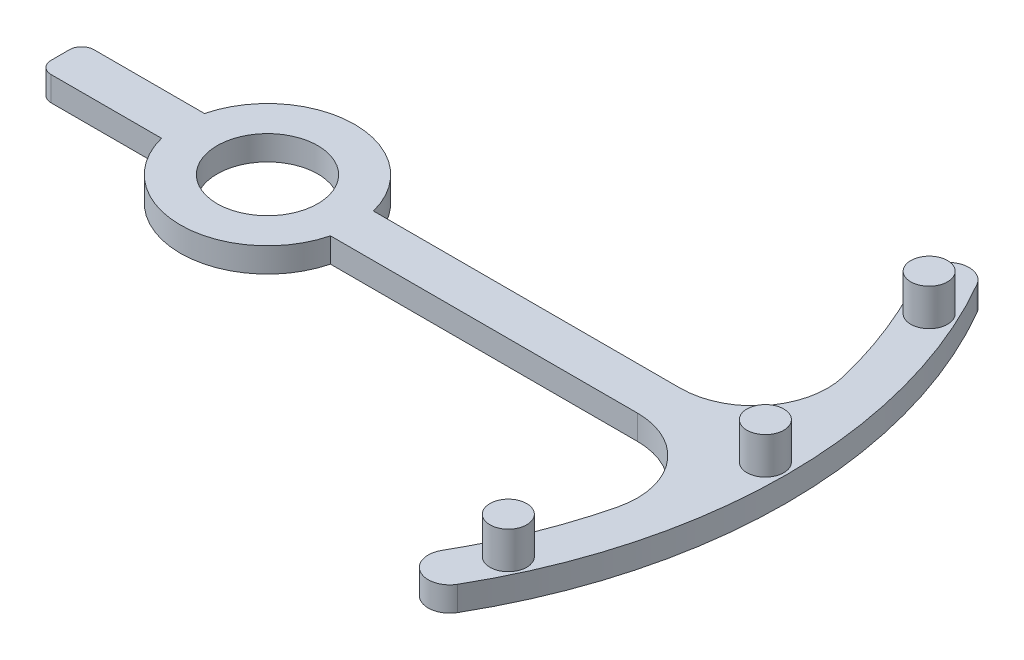
ISO-10303-21;
HEADER;
FILE_DESCRIPTION(('STEP AP214'),'2;1');
FILE_NAME('part.step','',(''),(''),'','','');
FILE_SCHEMA(('AUTOMOTIVE_DESIGN { 1 0 10303 214 1 1 1 1 }'));
ENDSEC;
DATA;
#1=APPLICATION_CONTEXT('core data for automotive mechanical design processes');
#2=APPLICATION_PROTOCOL_DEFINITION('international standard','automotive_design',2000,#1);
#3=PRODUCT_CONTEXT('',#1,'mechanical');
#4=PRODUCT('Part','Part','',(#3));
#5=PRODUCT_RELATED_PRODUCT_CATEGORY('part','',(#4));
#6=PRODUCT_DEFINITION_FORMATION('','',#4);
#7=PRODUCT_DEFINITION_CONTEXT('part definition',#1,'design');
#8=PRODUCT_DEFINITION('design','',#6,#7);
#9=PRODUCT_DEFINITION_SHAPE('','',#8);
#10=(LENGTH_UNIT() NAMED_UNIT(*) SI_UNIT(.MILLI.,.METRE.));
#11=(NAMED_UNIT(*) PLANE_ANGLE_UNIT() SI_UNIT($,.RADIAN.));
#12=(NAMED_UNIT(*) SI_UNIT($,.STERADIAN.) SOLID_ANGLE_UNIT());
#13=UNCERTAINTY_MEASURE_WITH_UNIT(LENGTH_MEASURE(1.E-05),#10,'distance_accuracy_value','');
#14=(GEOMETRIC_REPRESENTATION_CONTEXT(3) GLOBAL_UNCERTAINTY_ASSIGNED_CONTEXT((#13)) GLOBAL_UNIT_ASSIGNED_CONTEXT((#10,
#11,#12)) REPRESENTATION_CONTEXT('',''));
#15=CARTESIAN_POINT('',(0.,0.,0.));
#16=DIRECTION('',(0.,0.,1.));
#17=DIRECTION('',(1.,0.,0.));
#18=AXIS2_PLACEMENT_3D('',#15,#16,#17);
#19=CARTESIAN_POINT('',(0.,2.,0.));
#20=DIRECTION('',(0.,1.,0.));
#21=DIRECTION('',(0.,0.,1.));
#22=AXIS2_PLACEMENT_3D('',#19,#20,#21);
#23=PLANE('',#22);
#24=CARTESIAN_POINT('',(40.5594244591551,2.,0.));
#25=DIRECTION('',(0.,1.,0.));
#26=DIRECTION('',(0.,0.,1.));
#27=AXIS2_PLACEMENT_3D('',#24,#25,#26);
#28=CIRCLE('',#27,1.5);
#29=CARTESIAN_POINT('',(40.5594244591551,2.,1.5));
#30=VERTEX_POINT('',#29);
#31=EDGE_CURVE('E347',#30,#30,#28,.T.);
#32=ORIENTED_EDGE('',*,*,#31,.F.);
#33=EDGE_LOOP('',(#32));
#34=FACE_BOUND('',#33,.T.);
#35=CARTESIAN_POINT('',(36.759322225057,2.,17.1411534621314));
#36=DIRECTION('',(0.,1.,0.));
#37=DIRECTION('',(0.,0.,-1.));
#38=AXIS2_PLACEMENT_3D('',#35,#36,#37);
#39=CIRCLE('',#38,1.5);
#40=CARTESIAN_POINT('',(36.759322225057,2.,15.6411534621314));
#41=VERTEX_POINT('',#40);
#42=EDGE_CURVE('E346',#41,#41,#39,.T.);
#43=ORIENTED_EDGE('',*,*,#42,.F.);
#44=EDGE_LOOP('',(#43));
#45=FACE_BOUND('',#44,.T.);
#46=CARTESIAN_POINT('',(36.759322225057,2.,-17.1411534621314));
#47=DIRECTION('',(0.,1.,0.));
#48=DIRECTION('',(0.,0.,1.));
#49=AXIS2_PLACEMENT_3D('',#46,#47,#48);
#50=CIRCLE('',#49,1.5);
#51=CARTESIAN_POINT('',(36.759322225057,2.,-15.6411534621314));
#52=VERTEX_POINT('',#51);
#53=EDGE_CURVE('E356',#52,#52,#50,.T.);
#54=ORIENTED_EDGE('',*,*,#53,.F.);
#55=EDGE_LOOP('',(#54));
#56=FACE_BOUND('',#55,.T.);
#57=CARTESIAN_POINT('',(0.,2.,0.));
#58=DIRECTION('',(0.,1.,0.));
#59=DIRECTION('',(0.,0.,1.));
#60=AXIS2_PLACEMENT_3D('',#57,#58,#59);
#61=CIRCLE('',#60,7.1000112);
#62=CARTESIAN_POINT('',(-6.88132233720513,2.,1.74858855412218));
#63=VERTEX_POINT('',#62);
#64=CARTESIAN_POINT('',(6.88096282348233,2.,1.75000276056338));
#65=VERTEX_POINT('',#64);
#66=EDGE_CURVE('E209',#63,#65,#61,.T.);
#67=ORIENTED_EDGE('',*,*,#66,.T.);
#68=DIRECTION('',(1.,0.,0.));
#69=VECTOR('',#68,1.);
#70=CARTESIAN_POINT('',(6.88096282348233,2.,1.75000276056338));
#71=LINE('',#70,#69);
#72=CARTESIAN_POINT('',(31.8809628234826,2.,1.75000276056338));
#73=VERTEX_POINT('',#72);
#74=EDGE_CURVE('E117',#65,#73,#71,.T.);
#75=ORIENTED_EDGE('',*,*,#74,.T.);
#76=CARTESIAN_POINT('',(31.8809628234823,2.,7.75000276056338));
#77=DIRECTION('',(0.,-1.,0.));
#78=DIRECTION('',(0.,0.,1.));
#79=AXIS2_PLACEMENT_3D('',#76,#77,#78);
#80=CIRCLE('',#79,6.);
#81=CARTESIAN_POINT('',(37.7111710668189,2.,9.16727896488293));
#82=VERTEX_POINT('',#81);
#83=EDGE_CURVE('E248',#73,#82,#80,.T.);
#84=ORIENTED_EDGE('',*,*,#83,.T.);
#85=CARTESIAN_POINT('',(0.,2.,0.));
#86=DIRECTION('',(0.,-1.,0.));
#87=DIRECTION('',(0.,0.,1.));
#88=AXIS2_PLACEMENT_3D('',#85,#86,#87);
#89=CIRCLE('',#88,38.8094244591551);
#90=CARTESIAN_POINT('',(33.6099474878814,2.,19.4047122295776));
#91=VERTEX_POINT('',#90);
#92=EDGE_CURVE('E267',#82,#91,#89,.T.);
#93=ORIENTED_EDGE('',*,*,#92,.T.);
#94=CARTESIAN_POINT('',(35.1254919445042,2.,20.2797122295776));
#95=DIRECTION('',(0.,1.,0.));
#96=DIRECTION('',(0.,0.,1.));
#97=AXIS2_PLACEMENT_3D('',#94,#95,#96);
#98=CIRCLE('',#97,1.74999999999999);
#99=CARTESIAN_POINT('',(36.6410364011269,2.,21.1547122295776));
#100=VERTEX_POINT('',#99);
#101=EDGE_CURVE('E264',#91,#100,#98,.T.);
#102=ORIENTED_EDGE('',*,*,#101,.T.);
#103=CARTESIAN_POINT('',(0.,2.,0.));
#104=DIRECTION('',(0.,1.,0.));
#105=DIRECTION('',(0.,0.,1.));
#106=AXIS2_PLACEMENT_3D('',#103,#104,#105);
#107=CIRCLE('',#106,42.3094244591551);
#108=CARTESIAN_POINT('',(36.6410364011269,2.,-21.1547122295776));
#109=VERTEX_POINT('',#108);
#110=EDGE_CURVE('E266',#100,#109,#107,.T.);
#111=ORIENTED_EDGE('',*,*,#110,.T.);
#112=CARTESIAN_POINT('',(35.1254919445042,2.,-20.2797122295776));
#113=DIRECTION('',(0.,1.,0.));
#114=DIRECTION('',(0.,0.,-1.));
#115=AXIS2_PLACEMENT_3D('',#112,#113,#114);
#116=CIRCLE('',#115,1.74999999999999);
#117=CARTESIAN_POINT('',(33.6099474878814,2.,-19.4047122295776));
#118=VERTEX_POINT('',#117);
#119=EDGE_CURVE('E269',#109,#118,#116,.T.);
#120=ORIENTED_EDGE('',*,*,#119,.T.);
#121=CARTESIAN_POINT('',(0.,2.,0.));
#122=DIRECTION('',(0.,-1.,0.));
#123=DIRECTION('',(0.,0.,1.));
#124=AXIS2_PLACEMENT_3D('',#121,#122,#123);
#125=CIRCLE('',#124,38.8094244591551);
#126=CARTESIAN_POINT('',(37.7111726544024,2.,-9.16727243408407));
#127=VERTEX_POINT('',#126);
#128=EDGE_CURVE('E275',#118,#127,#125,.T.);
#129=ORIENTED_EDGE('',*,*,#128,.T.);
#130=CARTESIAN_POINT('',(31.8809641656228,2.,-7.74999723943662));
#131=DIRECTION('',(0.,-1.,0.));
#132=DIRECTION('',(0.,0.,-1.));
#133=AXIS2_PLACEMENT_3D('',#130,#131,#132);
#134=CIRCLE('',#133,6.);
#135=CARTESIAN_POINT('',(31.8809641656226,2.,-1.74999723943662));
#136=VERTEX_POINT('',#135);
#137=EDGE_CURVE('E277',#127,#136,#134,.T.);
#138=ORIENTED_EDGE('',*,*,#137,.T.);
#139=DIRECTION('',(-1.,0.,0.));
#140=VECTOR('',#139,1.);
#141=CARTESIAN_POINT('',(6.88096422764181,2.,-1.74999723943758));
#142=LINE('',#141,#140);
#143=CARTESIAN_POINT('',(6.88096422764181,2.,-1.74999723943758));
#144=VERTEX_POINT('',#143);
#145=EDGE_CURVE('E279',#136,#144,#142,.T.);
#146=ORIENTED_EDGE('',*,*,#145,.T.);
#147=CARTESIAN_POINT('',(0.,2.,0.));
#148=DIRECTION('',(0.,1.,0.));
#149=DIRECTION('',(0.,0.,1.));
#150=AXIS2_PLACEMENT_3D('',#147,#148,#149);
#151=CIRCLE('',#150,7.1000112);
#152=CARTESIAN_POINT('',(-6.88132233720513,2.,-1.74858855412219));
#153=VERTEX_POINT('',#152);
#154=EDGE_CURVE('E281',#144,#153,#151,.T.);
#155=ORIENTED_EDGE('',*,*,#154,.T.);
#156=DIRECTION('',(-1.,0.,0.));
#157=VECTOR('',#156,1.);
#158=CARTESIAN_POINT('',(-6.88132233720513,2.,-1.74858855412218));
#159=LINE('',#158,#157);
#160=CARTESIAN_POINT('',(-15.8813223372051,2.,-1.74858855412218));
#161=VERTEX_POINT('',#160);
#162=EDGE_CURVE('E283',#153,#161,#159,.T.);
#163=ORIENTED_EDGE('',*,*,#162,.T.);
#164=CARTESIAN_POINT('',(-15.8813223372051,2.,-0.748588554122185));
#165=DIRECTION('',(0.,1.,0.));
#166=DIRECTION('',(0.,0.,1.));
#167=AXIS2_PLACEMENT_3D('',#164,#165,#166);
#168=CIRCLE('',#167,1.);
#169=CARTESIAN_POINT('',(-16.8813223372051,2.,-0.748588554122185));
#170=VERTEX_POINT('',#169);
#171=EDGE_CURVE('E160',#161,#170,#168,.T.);
#172=ORIENTED_EDGE('',*,*,#171,.T.);
#173=DIRECTION('',(0.,0.,1.));
#174=VECTOR('',#173,1.);
#175=CARTESIAN_POINT('',(-16.8813223372051,2.,-0.748588554122185));
#176=LINE('',#175,#174);
#177=CARTESIAN_POINT('',(-16.8813223372051,2.,0.748588554122185));
#178=VERTEX_POINT('',#177);
#179=EDGE_CURVE('E154',#170,#178,#176,.T.);
#180=ORIENTED_EDGE('',*,*,#179,.T.);
#181=CARTESIAN_POINT('',(-15.8813223372051,2.,0.748588554122185));
#182=DIRECTION('',(0.,1.,0.));
#183=DIRECTION('',(0.,0.,-1.));
#184=AXIS2_PLACEMENT_3D('',#181,#182,#183);
#185=CIRCLE('',#184,1.);
#186=CARTESIAN_POINT('',(-15.8813223372051,2.,1.74858855412219));
#187=VERTEX_POINT('',#186);
#188=EDGE_CURVE('E158',#178,#187,#185,.T.);
#189=ORIENTED_EDGE('',*,*,#188,.T.);
#190=DIRECTION('',(1.,0.,0.));
#191=VECTOR('',#190,1.);
#192=CARTESIAN_POINT('',(-6.88132233720513,2.,1.74858855412218));
#193=LINE('',#192,#191);
#194=EDGE_CURVE('E50',#187,#63,#193,.T.);
#195=ORIENTED_EDGE('',*,*,#194,.T.);
#196=EDGE_LOOP('',(#67,#75,#84,#93,#102,#111,#120,#129,#138,#146,#155,#163,#172,#180,#189,#195));
#197=FACE_BOUND('',#196,.T.);
#198=CARTESIAN_POINT('',(0.,2.,0.));
#199=DIRECTION('',(0.,1.,0.));
#200=DIRECTION('',(0.,0.,1.));
#201=AXIS2_PLACEMENT_3D('',#198,#199,#200);
#202=CIRCLE('',#201,4.1);
#203=CARTESIAN_POINT('',(0.,2.,4.1));
#204=VERTEX_POINT('',#203);
#205=EDGE_CURVE('E182',#204,#204,#202,.T.);
#206=ORIENTED_EDGE('',*,*,#205,.F.);
#207=EDGE_LOOP('',(#206));
#208=FACE_BOUND('',#207,.T.);
#209=ADVANCED_FACE('F33',(#34,#45,#56,#197,#208),#23,.T.);
#210=CARTESIAN_POINT('',(0.,0.,0.));
#211=DIRECTION('',(0.,1.,0.));
#212=DIRECTION('',(0.,0.,1.));
#213=AXIS2_PLACEMENT_3D('',#210,#211,#212);
#214=PLANE('',#213);
#215=CARTESIAN_POINT('',(0.,0.,0.));
#216=DIRECTION('',(0.,1.,0.));
#217=DIRECTION('',(0.,0.,1.));
#218=AXIS2_PLACEMENT_3D('',#215,#216,#217);
#219=CIRCLE('',#218,7.1000112);
#220=CARTESIAN_POINT('',(-6.88132233720513,0.,1.74858855412218));
#221=VERTEX_POINT('',#220);
#222=CARTESIAN_POINT('',(6.88096282348233,0.,1.75000276056338));
#223=VERTEX_POINT('',#222);
#224=EDGE_CURVE('E178',#221,#223,#219,.T.);
#225=ORIENTED_EDGE('',*,*,#224,.F.);
#226=DIRECTION('',(1.,0.,0.));
#227=VECTOR('',#226,1.);
#228=CARTESIAN_POINT('',(-6.88132233720513,0.,1.74858855412218));
#229=LINE('',#228,#227);
#230=CARTESIAN_POINT('',(-15.8813223372051,0.,1.74858855412219));
#231=VERTEX_POINT('',#230);
#232=EDGE_CURVE('E109',#231,#221,#229,.T.);
#233=ORIENTED_EDGE('',*,*,#232,.F.);
#234=CARTESIAN_POINT('',(-15.8813223372051,0.,0.748588554122185));
#235=DIRECTION('',(0.,1.,0.));
#236=DIRECTION('',(0.,0.,-1.));
#237=AXIS2_PLACEMENT_3D('',#234,#235,#236);
#238=CIRCLE('',#237,1.);
#239=CARTESIAN_POINT('',(-16.8813223372051,0.,0.748588554122185));
#240=VERTEX_POINT('',#239);
#241=EDGE_CURVE('E103',#240,#231,#238,.T.);
#242=ORIENTED_EDGE('',*,*,#241,.F.);
#243=DIRECTION('',(0.,0.,1.));
#244=VECTOR('',#243,1.);
#245=CARTESIAN_POINT('',(-16.8813223372051,0.,-0.748588554122185));
#246=LINE('',#245,#244);
#247=CARTESIAN_POINT('',(-16.8813223372051,0.,-0.748588554122185));
#248=VERTEX_POINT('',#247);
#249=EDGE_CURVE('E168',#248,#240,#246,.T.);
#250=ORIENTED_EDGE('',*,*,#249,.F.);
#251=CARTESIAN_POINT('',(-15.8813223372051,0.,-0.748588554122185));
#252=DIRECTION('',(0.,1.,0.));
#253=DIRECTION('',(0.,0.,1.));
#254=AXIS2_PLACEMENT_3D('',#251,#252,#253);
#255=CIRCLE('',#254,1.);
#256=CARTESIAN_POINT('',(-15.8813223372051,0.,-1.74858855412218));
#257=VERTEX_POINT('',#256);
#258=EDGE_CURVE('E204',#257,#248,#255,.T.);
#259=ORIENTED_EDGE('',*,*,#258,.F.);
#260=DIRECTION('',(-1.,0.,0.));
#261=VECTOR('',#260,1.);
#262=CARTESIAN_POINT('',(-6.88132233720513,0.,-1.74858855412218));
#263=LINE('',#262,#261);
#264=CARTESIAN_POINT('',(-6.88132233720513,0.,-1.74858855412219));
#265=VERTEX_POINT('',#264);
#266=EDGE_CURVE('E202',#265,#257,#263,.T.);
#267=ORIENTED_EDGE('',*,*,#266,.F.);
#268=CARTESIAN_POINT('',(0.,0.,0.));
#269=DIRECTION('',(0.,1.,0.));
#270=DIRECTION('',(0.,0.,1.));
#271=AXIS2_PLACEMENT_3D('',#268,#269,#270);
#272=CIRCLE('',#271,7.1000112);
#273=CARTESIAN_POINT('',(6.88096422764181,0.,-1.74999723943758));
#274=VERTEX_POINT('',#273);
#275=EDGE_CURVE('E200',#274,#265,#272,.T.);
#276=ORIENTED_EDGE('',*,*,#275,.F.);
#277=DIRECTION('',(-1.,0.,0.));
#278=VECTOR('',#277,1.);
#279=CARTESIAN_POINT('',(6.88096422764181,0.,-1.74999723943758));
#280=LINE('',#279,#278);
#281=CARTESIAN_POINT('',(31.8809641656226,0.,-1.74999723943662));
#282=VERTEX_POINT('',#281);
#283=EDGE_CURVE('E198',#282,#274,#280,.T.);
#284=ORIENTED_EDGE('',*,*,#283,.F.);
#285=CARTESIAN_POINT('',(31.8809641656228,0.,-7.74999723943662));
#286=DIRECTION('',(0.,-1.,0.));
#287=DIRECTION('',(0.,0.,-1.));
#288=AXIS2_PLACEMENT_3D('',#285,#286,#287);
#289=CIRCLE('',#288,6.);
#290=CARTESIAN_POINT('',(37.7111726544024,0.,-9.16727243408407));
#291=VERTEX_POINT('',#290);
#292=EDGE_CURVE('E196',#291,#282,#289,.T.);
#293=ORIENTED_EDGE('',*,*,#292,.F.);
#294=CARTESIAN_POINT('',(0.,0.,0.));
#295=DIRECTION('',(0.,-1.,0.));
#296=DIRECTION('',(0.,0.,1.));
#297=AXIS2_PLACEMENT_3D('',#294,#295,#296);
#298=CIRCLE('',#297,38.8094244591551);
#299=CARTESIAN_POINT('',(33.6099474878814,0.,-19.4047122295776));
#300=VERTEX_POINT('',#299);
#301=EDGE_CURVE('E194',#300,#291,#298,.T.);
#302=ORIENTED_EDGE('',*,*,#301,.F.);
#303=CARTESIAN_POINT('',(35.1254919445042,0.,-20.2797122295776));
#304=DIRECTION('',(0.,1.,0.));
#305=DIRECTION('',(0.,0.,-1.));
#306=AXIS2_PLACEMENT_3D('',#303,#304,#305);
#307=CIRCLE('',#306,1.74999999999999);
#308=CARTESIAN_POINT('',(36.6410364011269,0.,-21.1547122295776));
#309=VERTEX_POINT('',#308);
#310=EDGE_CURVE('E192',#309,#300,#307,.T.);
#311=ORIENTED_EDGE('',*,*,#310,.F.);
#312=CARTESIAN_POINT('',(0.,0.,0.));
#313=DIRECTION('',(0.,1.,0.));
#314=DIRECTION('',(0.,0.,1.));
#315=AXIS2_PLACEMENT_3D('',#312,#313,#314);
#316=CIRCLE('',#315,42.3094244591551);
#317=CARTESIAN_POINT('',(36.6410364011269,0.,21.1547122295776));
#318=VERTEX_POINT('',#317);
#319=EDGE_CURVE('E190',#318,#309,#316,.T.);
#320=ORIENTED_EDGE('',*,*,#319,.F.);
#321=CARTESIAN_POINT('',(35.1254919445042,0.,20.2797122295776));
#322=DIRECTION('',(0.,1.,0.));
#323=DIRECTION('',(0.,0.,1.));
#324=AXIS2_PLACEMENT_3D('',#321,#322,#323);
#325=CIRCLE('',#324,1.74999999999999);
#326=CARTESIAN_POINT('',(33.6099474878814,0.,19.4047122295776));
#327=VERTEX_POINT('',#326);
#328=EDGE_CURVE('E188',#327,#318,#325,.T.);
#329=ORIENTED_EDGE('',*,*,#328,.F.);
#330=CARTESIAN_POINT('',(0.,0.,0.));
#331=DIRECTION('',(0.,-1.,0.));
#332=DIRECTION('',(0.,0.,1.));
#333=AXIS2_PLACEMENT_3D('',#330,#331,#332);
#334=CIRCLE('',#333,38.8094244591551);
#335=CARTESIAN_POINT('',(37.7111710668189,0.,9.16727896488293));
#336=VERTEX_POINT('',#335);
#337=EDGE_CURVE('E186',#336,#327,#334,.T.);
#338=ORIENTED_EDGE('',*,*,#337,.F.);
#339=CARTESIAN_POINT('',(31.8809628234823,0.,7.75000276056338));
#340=DIRECTION('',(0.,-1.,0.));
#341=DIRECTION('',(0.,0.,1.));
#342=AXIS2_PLACEMENT_3D('',#339,#340,#341);
#343=CIRCLE('',#342,6.);
#344=CARTESIAN_POINT('',(31.8809628234826,0.,1.75000276056338));
#345=VERTEX_POINT('',#344);
#346=EDGE_CURVE('E184',#345,#336,#343,.T.);
#347=ORIENTED_EDGE('',*,*,#346,.F.);
#348=DIRECTION('',(1.,0.,0.));
#349=VECTOR('',#348,1.);
#350=CARTESIAN_POINT('',(6.88096282348233,0.,1.75000276056338));
#351=LINE('',#350,#349);
#352=EDGE_CURVE('E181',#223,#345,#351,.T.);
#353=ORIENTED_EDGE('',*,*,#352,.F.);
#354=EDGE_LOOP('',(#225,#233,#242,#250,#259,#267,#276,#284,#293,#302,#311,#320,#329,#338,#347,#353));
#355=FACE_BOUND('',#354,.T.);
#356=CARTESIAN_POINT('',(0.,0.,0.));
#357=DIRECTION('',(0.,1.,0.));
#358=DIRECTION('',(0.,0.,1.));
#359=AXIS2_PLACEMENT_3D('',#356,#357,#358);
#360=CIRCLE('',#359,4.1);
#361=CARTESIAN_POINT('',(0.,0.,4.1));
#362=VERTEX_POINT('',#361);
#363=EDGE_CURVE('E361',#362,#362,#360,.T.);
#364=ORIENTED_EDGE('',*,*,#363,.T.);
#365=EDGE_LOOP('',(#364));
#366=FACE_BOUND('',#365,.T.);
#367=ADVANCED_FACE('F252',(#355,#366),#214,.F.);
#368=CARTESIAN_POINT('',(0.,2.,0.));
#369=DIRECTION('',(0.,-1.,0.));
#370=DIRECTION('',(0.,0.,-1.));
#371=AXIS2_PLACEMENT_3D('',#368,#369,#370);
#372=CYLINDRICAL_SURFACE('',#371,7.1000112);
#373=ORIENTED_EDGE('',*,*,#224,.T.);
#374=DIRECTION('',(0.,-1.,0.));
#375=VECTOR('',#374,1.);
#376=CARTESIAN_POINT('',(6.88096282348233,2.,1.75000276056338));
#377=LINE('',#376,#375);
#378=EDGE_CURVE('E11',#65,#223,#377,.T.);
#379=ORIENTED_EDGE('',*,*,#378,.F.);
#380=ORIENTED_EDGE('',*,*,#66,.F.);
#381=DIRECTION('',(0.,-1.,0.));
#382=VECTOR('',#381,1.);
#383=CARTESIAN_POINT('',(-6.88132233720513,2.,1.74858855412218));
#384=LINE('',#383,#382);
#385=EDGE_CURVE('E174',#63,#221,#384,.T.);
#386=ORIENTED_EDGE('',*,*,#385,.T.);
#387=EDGE_LOOP('',(#373,#379,#380,#386));
#388=FACE_BOUND('',#387,.T.);
#389=ADVANCED_FACE('F35',(#388),#372,.T.);
#390=CARTESIAN_POINT('',(6.88096282348233,2.,1.75000276056338));
#391=DIRECTION('',(0.,0.,-1.));
#392=DIRECTION('',(-1.,0.,0.));
#393=AXIS2_PLACEMENT_3D('',#390,#391,#392);
#394=PLANE('',#393);
#395=ORIENTED_EDGE('',*,*,#352,.T.);
#396=DIRECTION('',(0.,-1.,0.));
#397=VECTOR('',#396,1.);
#398=CARTESIAN_POINT('',(31.8809628234826,2.,1.75000276056338));
#399=LINE('',#398,#397);
#400=EDGE_CURVE('E42',#73,#345,#399,.T.);
#401=ORIENTED_EDGE('',*,*,#400,.F.);
#402=ORIENTED_EDGE('',*,*,#74,.F.);
#403=ORIENTED_EDGE('',*,*,#378,.T.);
#404=EDGE_LOOP('',(#395,#401,#402,#403));
#405=FACE_BOUND('',#404,.T.);
#406=ADVANCED_FACE('F426',(#405),#394,.F.);
#407=CARTESIAN_POINT('',(31.8809628234823,2.,7.75000276056338));
#408=DIRECTION('',(0.,-1.,0.));
#409=DIRECTION('',(0.,0.,-1.));
#410=AXIS2_PLACEMENT_3D('',#407,#408,#409);
#411=CYLINDRICAL_SURFACE('',#410,6.);
#412=ORIENTED_EDGE('',*,*,#346,.T.);
#413=DIRECTION('',(0.,-1.,0.));
#414=VECTOR('',#413,1.);
#415=CARTESIAN_POINT('',(37.7111710668189,2.,9.16727896488293));
#416=LINE('',#415,#414);
#417=EDGE_CURVE('E240',#82,#336,#416,.T.);
#418=ORIENTED_EDGE('',*,*,#417,.F.);
#419=ORIENTED_EDGE('',*,*,#83,.F.);
#420=ORIENTED_EDGE('',*,*,#400,.T.);
#421=EDGE_LOOP('',(#412,#418,#419,#420));
#422=FACE_BOUND('',#421,.T.);
#423=ADVANCED_FACE('F246',(#422),#411,.F.);
#424=CARTESIAN_POINT('',(0.,2.,0.));
#425=DIRECTION('',(0.,-1.,0.));
#426=DIRECTION('',(0.,0.,-1.));
#427=AXIS2_PLACEMENT_3D('',#424,#425,#426);
#428=CYLINDRICAL_SURFACE('',#427,38.8094244591551);
#429=ORIENTED_EDGE('',*,*,#337,.T.);
#430=DIRECTION('',(0.,-1.,0.));
#431=VECTOR('',#430,1.);
#432=CARTESIAN_POINT('',(33.6099474878814,2.,19.4047122295776));
#433=LINE('',#432,#431);
#434=EDGE_CURVE('E237',#91,#327,#433,.T.);
#435=ORIENTED_EDGE('',*,*,#434,.F.);
#436=ORIENTED_EDGE('',*,*,#92,.F.);
#437=ORIENTED_EDGE('',*,*,#417,.T.);
#438=EDGE_LOOP('',(#429,#435,#436,#437));
#439=FACE_BOUND('',#438,.T.);
#440=ADVANCED_FACE('F258',(#439),#428,.F.);
#441=CARTESIAN_POINT('',(35.1254919445042,2.,20.2797122295776));
#442=DIRECTION('',(0.,-1.,0.));
#443=DIRECTION('',(0.,0.,-1.));
#444=AXIS2_PLACEMENT_3D('',#441,#442,#443);
#445=CYLINDRICAL_SURFACE('',#444,1.74999999999999);
#446=ORIENTED_EDGE('',*,*,#328,.T.);
#447=DIRECTION('',(0.,-1.,0.));
#448=VECTOR('',#447,1.);
#449=CARTESIAN_POINT('',(36.6410364011269,2.,21.1547122295776));
#450=LINE('',#449,#448);
#451=EDGE_CURVE('E234',#100,#318,#450,.T.);
#452=ORIENTED_EDGE('',*,*,#451,.F.);
#453=ORIENTED_EDGE('',*,*,#101,.F.);
#454=ORIENTED_EDGE('',*,*,#434,.T.);
#455=EDGE_LOOP('',(#446,#452,#453,#454));
#456=FACE_BOUND('',#455,.T.);
#457=ADVANCED_FACE('F262',(#456),#445,.T.);
#458=CARTESIAN_POINT('',(0.,2.,0.));
#459=DIRECTION('',(0.,-1.,0.));
#460=DIRECTION('',(0.,0.,-1.));
#461=AXIS2_PLACEMENT_3D('',#458,#459,#460);
#462=CYLINDRICAL_SURFACE('',#461,42.3094244591551);
#463=ORIENTED_EDGE('',*,*,#319,.T.);
#464=DIRECTION('',(0.,-1.,0.));
#465=VECTOR('',#464,1.);
#466=CARTESIAN_POINT('',(36.6410364011269,2.,-21.1547122295776));
#467=LINE('',#466,#465);
#468=EDGE_CURVE('E231',#109,#309,#467,.T.);
#469=ORIENTED_EDGE('',*,*,#468,.F.);
#470=ORIENTED_EDGE('',*,*,#110,.F.);
#471=ORIENTED_EDGE('',*,*,#451,.T.);
#472=EDGE_LOOP('',(#463,#469,#470,#471));
#473=FACE_BOUND('',#472,.T.);
#474=ADVANCED_FACE('F453',(#473),#462,.T.);
#475=CARTESIAN_POINT('',(35.1254919445042,2.,-20.2797122295776));
#476=DIRECTION('',(0.,-1.,0.));
#477=DIRECTION('',(0.,0.,-1.));
#478=AXIS2_PLACEMENT_3D('',#475,#476,#477);
#479=CYLINDRICAL_SURFACE('',#478,1.74999999999999);
#480=ORIENTED_EDGE('',*,*,#310,.T.);
#481=DIRECTION('',(0.,-1.,0.));
#482=VECTOR('',#481,1.);
#483=CARTESIAN_POINT('',(33.6099474878814,2.,-19.4047122295776));
#484=LINE('',#483,#482);
#485=EDGE_CURVE('E228',#118,#300,#484,.T.);
#486=ORIENTED_EDGE('',*,*,#485,.F.);
#487=ORIENTED_EDGE('',*,*,#119,.F.);
#488=ORIENTED_EDGE('',*,*,#468,.T.);
#489=EDGE_LOOP('',(#480,#486,#487,#488));
#490=FACE_BOUND('',#489,.T.);
#491=ADVANCED_FACE('F461',(#490),#479,.T.);
#492=CARTESIAN_POINT('',(0.,2.,0.));
#493=DIRECTION('',(0.,-1.,0.));
#494=DIRECTION('',(0.,0.,-1.));
#495=AXIS2_PLACEMENT_3D('',#492,#493,#494);
#496=CYLINDRICAL_SURFACE('',#495,38.8094244591551);
#497=ORIENTED_EDGE('',*,*,#301,.T.);
#498=DIRECTION('',(0.,-1.,0.));
#499=VECTOR('',#498,1.);
#500=CARTESIAN_POINT('',(37.7111726544024,2.,-9.16727243408407));
#501=LINE('',#500,#499);
#502=EDGE_CURVE('E225',#127,#291,#501,.T.);
#503=ORIENTED_EDGE('',*,*,#502,.F.);
#504=ORIENTED_EDGE('',*,*,#128,.F.);
#505=ORIENTED_EDGE('',*,*,#485,.T.);
#506=EDGE_LOOP('',(#497,#503,#504,#505));
#507=FACE_BOUND('',#506,.T.);
#508=ADVANCED_FACE('F470',(#507),#496,.F.);
#509=CARTESIAN_POINT('',(31.8809641656228,2.,-7.74999723943662));
#510=DIRECTION('',(0.,-1.,0.));
#511=DIRECTION('',(0.,0.,-1.));
#512=AXIS2_PLACEMENT_3D('',#509,#510,#511);
#513=CYLINDRICAL_SURFACE('',#512,6.);
#514=ORIENTED_EDGE('',*,*,#292,.T.);
#515=DIRECTION('',(0.,-1.,0.));
#516=VECTOR('',#515,1.);
#517=CARTESIAN_POINT('',(31.8809641656226,2.,-1.74999723943662));
#518=LINE('',#517,#516);
#519=EDGE_CURVE('E222',#136,#282,#518,.T.);
#520=ORIENTED_EDGE('',*,*,#519,.F.);
#521=ORIENTED_EDGE('',*,*,#137,.F.);
#522=ORIENTED_EDGE('',*,*,#502,.T.);
#523=EDGE_LOOP('',(#514,#520,#521,#522));
#524=FACE_BOUND('',#523,.T.);
#525=ADVANCED_FACE('F479',(#524),#513,.F.);
#526=CARTESIAN_POINT('',(6.88096422764181,2.,-1.74999723943758));
#527=DIRECTION('',(0.,0.,1.));
#528=DIRECTION('',(1.,0.,0.));
#529=AXIS2_PLACEMENT_3D('',#526,#527,#528);
#530=PLANE('',#529);
#531=ORIENTED_EDGE('',*,*,#283,.T.);
#532=DIRECTION('',(0.,-1.,0.));
#533=VECTOR('',#532,1.);
#534=CARTESIAN_POINT('',(6.88096422764181,2.,-1.74999723943758));
#535=LINE('',#534,#533);
#536=EDGE_CURVE('E219',#144,#274,#535,.T.);
#537=ORIENTED_EDGE('',*,*,#536,.F.);
#538=ORIENTED_EDGE('',*,*,#145,.F.);
#539=ORIENTED_EDGE('',*,*,#519,.T.);
#540=EDGE_LOOP('',(#531,#537,#538,#539));
#541=FACE_BOUND('',#540,.T.);
#542=ADVANCED_FACE('F488',(#541),#530,.F.);
#543=CARTESIAN_POINT('',(0.,2.,0.));
#544=DIRECTION('',(0.,-1.,0.));
#545=DIRECTION('',(0.,0.,-1.));
#546=AXIS2_PLACEMENT_3D('',#543,#544,#545);
#547=CYLINDRICAL_SURFACE('',#546,7.1000112);
#548=ORIENTED_EDGE('',*,*,#275,.T.);
#549=DIRECTION('',(0.,-1.,0.));
#550=VECTOR('',#549,1.);
#551=CARTESIAN_POINT('',(-6.88132233720513,2.,-1.74858855412219));
#552=LINE('',#551,#550);
#553=EDGE_CURVE('E216',#153,#265,#552,.T.);
#554=ORIENTED_EDGE('',*,*,#553,.F.);
#555=ORIENTED_EDGE('',*,*,#154,.F.);
#556=ORIENTED_EDGE('',*,*,#536,.T.);
#557=EDGE_LOOP('',(#548,#554,#555,#556));
#558=FACE_BOUND('',#557,.T.);
#559=ADVANCED_FACE('F497',(#558),#547,.T.);
#560=CARTESIAN_POINT('',(-6.88132233720513,2.,-1.74858855412218));
#561=DIRECTION('',(0.,0.,1.));
#562=DIRECTION('',(1.,0.,0.));
#563=AXIS2_PLACEMENT_3D('',#560,#561,#562);
#564=PLANE('',#563);
#565=ORIENTED_EDGE('',*,*,#266,.T.);
#566=DIRECTION('',(0.,-1.,0.));
#567=VECTOR('',#566,1.);
#568=CARTESIAN_POINT('',(-15.8813223372051,2.,-1.74858855412218));
#569=LINE('',#568,#567);
#570=EDGE_CURVE('E213',#161,#257,#569,.T.);
#571=ORIENTED_EDGE('',*,*,#570,.F.);
#572=ORIENTED_EDGE('',*,*,#162,.F.);
#573=ORIENTED_EDGE('',*,*,#553,.T.);
#574=EDGE_LOOP('',(#565,#571,#572,#573));
#575=FACE_BOUND('',#574,.T.);
#576=ADVANCED_FACE('F289',(#575),#564,.F.);
#577=CARTESIAN_POINT('',(-15.8813223372051,2.,-0.748588554122185));
#578=DIRECTION('',(0.,-1.,0.));
#579=DIRECTION('',(0.,0.,-1.));
#580=AXIS2_PLACEMENT_3D('',#577,#578,#579);
#581=CYLINDRICAL_SURFACE('',#580,1.);
#582=ORIENTED_EDGE('',*,*,#258,.T.);
#583=DIRECTION('',(0.,-1.,0.));
#584=VECTOR('',#583,1.);
#585=CARTESIAN_POINT('',(-16.8813223372051,2.,-0.748588554122185));
#586=LINE('',#585,#584);
#587=EDGE_CURVE('E169',#170,#248,#586,.T.);
#588=ORIENTED_EDGE('',*,*,#587,.F.);
#589=ORIENTED_EDGE('',*,*,#171,.F.);
#590=ORIENTED_EDGE('',*,*,#570,.T.);
#591=EDGE_LOOP('',(#582,#588,#589,#590));
#592=FACE_BOUND('',#591,.T.);
#593=ADVANCED_FACE('F293',(#592),#581,.T.);
#594=CARTESIAN_POINT('',(-16.8813223372051,2.,-0.748588554122185));
#595=DIRECTION('',(1.,0.,0.));
#596=DIRECTION('',(0.,0.,-1.));
#597=AXIS2_PLACEMENT_3D('',#594,#595,#596);
#598=PLANE('',#597);
#599=ORIENTED_EDGE('',*,*,#249,.T.);
#600=DIRECTION('',(0.,-1.,0.));
#601=VECTOR('',#600,1.);
#602=CARTESIAN_POINT('',(-16.8813223372051,2.,0.748588554122185));
#603=LINE('',#602,#601);
#604=EDGE_CURVE('E165',#178,#240,#603,.T.);
#605=ORIENTED_EDGE('',*,*,#604,.F.);
#606=ORIENTED_EDGE('',*,*,#179,.F.);
#607=ORIENTED_EDGE('',*,*,#587,.T.);
#608=EDGE_LOOP('',(#599,#605,#606,#607));
#609=FACE_BOUND('',#608,.T.);
#610=ADVANCED_FACE('F166',(#609),#598,.F.);
#611=CARTESIAN_POINT('',(-15.8813223372051,2.,0.748588554122185));
#612=DIRECTION('',(0.,-1.,0.));
#613=DIRECTION('',(0.,0.,-1.));
#614=AXIS2_PLACEMENT_3D('',#611,#612,#613);
#615=CYLINDRICAL_SURFACE('',#614,1.);
#616=ORIENTED_EDGE('',*,*,#241,.T.);
#617=DIRECTION('',(0.,-1.,0.));
#618=VECTOR('',#617,1.);
#619=CARTESIAN_POINT('',(-15.8813223372051,2.,1.74858855412219));
#620=LINE('',#619,#618);
#621=EDGE_CURVE('E170',#187,#231,#620,.T.);
#622=ORIENTED_EDGE('',*,*,#621,.F.);
#623=ORIENTED_EDGE('',*,*,#188,.F.);
#624=ORIENTED_EDGE('',*,*,#604,.T.);
#625=EDGE_LOOP('',(#616,#622,#623,#624));
#626=FACE_BOUND('',#625,.T.);
#627=ADVANCED_FACE('F172',(#626),#615,.T.);
#628=CARTESIAN_POINT('',(-6.88132233720513,2.,1.74858855412218));
#629=DIRECTION('',(0.,0.,-1.));
#630=DIRECTION('',(-1.,0.,0.));
#631=AXIS2_PLACEMENT_3D('',#628,#629,#630);
#632=PLANE('',#631);
#633=ORIENTED_EDGE('',*,*,#232,.T.);
#634=ORIENTED_EDGE('',*,*,#385,.F.);
#635=ORIENTED_EDGE('',*,*,#194,.F.);
#636=ORIENTED_EDGE('',*,*,#621,.T.);
#637=EDGE_LOOP('',(#633,#634,#635,#636));
#638=FACE_BOUND('',#637,.T.);
#639=ADVANCED_FACE('F297',(#638),#632,.F.);
#640=CARTESIAN_POINT('',(0.,2.,0.));
#641=DIRECTION('',(0.,-1.,0.));
#642=DIRECTION('',(0.,0.,-1.));
#643=AXIS2_PLACEMENT_3D('',#640,#641,#642);
#644=CYLINDRICAL_SURFACE('',#643,4.1);
#645=ORIENTED_EDGE('',*,*,#205,.T.);
#646=EDGE_LOOP('',(#645));
#647=FACE_BOUND('',#646,.T.);
#648=ORIENTED_EDGE('',*,*,#363,.F.);
#649=EDGE_LOOP('',(#648));
#650=FACE_BOUND('',#649,.T.);
#651=ADVANCED_FACE('F299',(#647,#650),#644,.F.);
#652=CARTESIAN_POINT('',(36.759322225057,5.,-17.1411534621314));
#653=DIRECTION('',(0.,-1.,0.));
#654=DIRECTION('',(0.,0.,-1.));
#655=AXIS2_PLACEMENT_3D('',#652,#653,#654);
#656=CYLINDRICAL_SURFACE('',#655,1.5);
#657=CARTESIAN_POINT('',(36.759322225057,5.,-17.1411534621314));
#658=DIRECTION('',(0.,1.,0.));
#659=DIRECTION('',(0.,0.,1.));
#660=AXIS2_PLACEMENT_3D('',#657,#658,#659);
#661=CIRCLE('',#660,1.5);
#662=CARTESIAN_POINT('',(36.759322225057,5.,-15.6411534621314));
#663=VERTEX_POINT('',#662);
#664=EDGE_CURVE('E358',#663,#663,#661,.T.);
#665=ORIENTED_EDGE('',*,*,#664,.F.);
#666=EDGE_LOOP('',(#665));
#667=FACE_BOUND('',#666,.T.);
#668=ORIENTED_EDGE('',*,*,#53,.T.);
#669=EDGE_LOOP('',(#668));
#670=FACE_BOUND('',#669,.T.);
#671=ADVANCED_FACE('F305',(#667,#670),#656,.T.);
#672=CARTESIAN_POINT('',(36.759322225057,5.,-17.1411534621314));
#673=DIRECTION('',(0.,1.,0.));
#674=DIRECTION('',(0.,0.,1.));
#675=AXIS2_PLACEMENT_3D('',#672,#673,#674);
#676=PLANE('',#675);
#677=ORIENTED_EDGE('',*,*,#664,.T.);
#678=EDGE_LOOP('',(#677));
#679=FACE_BOUND('',#678,.T.);
#680=ADVANCED_FACE('F321',(#679),#676,.T.);
#681=CARTESIAN_POINT('',(36.759322225057,5.,17.1411534621314));
#682=DIRECTION('',(0.,-1.,0.));
#683=DIRECTION('',(0.,0.,-1.));
#684=AXIS2_PLACEMENT_3D('',#681,#682,#683);
#685=CYLINDRICAL_SURFACE('',#684,1.5);
#686=CARTESIAN_POINT('',(36.759322225057,5.,17.1411534621314));
#687=DIRECTION('',(0.,1.,0.));
#688=DIRECTION('',(0.,0.,-1.));
#689=AXIS2_PLACEMENT_3D('',#686,#687,#688);
#690=CIRCLE('',#689,1.5);
#691=CARTESIAN_POINT('',(36.759322225057,5.,15.6411534621314));
#692=VERTEX_POINT('',#691);
#693=EDGE_CURVE('E350',#692,#692,#690,.T.);
#694=ORIENTED_EDGE('',*,*,#693,.F.);
#695=EDGE_LOOP('',(#694));
#696=FACE_BOUND('',#695,.T.);
#697=ORIENTED_EDGE('',*,*,#42,.T.);
#698=EDGE_LOOP('',(#697));
#699=FACE_BOUND('',#698,.T.);
#700=ADVANCED_FACE('F325',(#696,#699),#685,.T.);
#701=CARTESIAN_POINT('',(36.759322225057,5.,17.1411534621314));
#702=DIRECTION('',(0.,-1.,0.));
#703=DIRECTION('',(0.,0.,-1.));
#704=AXIS2_PLACEMENT_3D('',#701,#702,#703);
#705=PLANE('',#704);
#706=ORIENTED_EDGE('',*,*,#693,.T.);
#707=EDGE_LOOP('',(#706));
#708=FACE_BOUND('',#707,.T.);
#709=ADVANCED_FACE('F329',(#708),#705,.F.);
#710=CARTESIAN_POINT('',(40.5594244591551,5.,0.));
#711=DIRECTION('',(0.,-1.,0.));
#712=DIRECTION('',(0.,0.,-1.));
#713=AXIS2_PLACEMENT_3D('',#710,#711,#712);
#714=CYLINDRICAL_SURFACE('',#713,1.5);
#715=CARTESIAN_POINT('',(40.5594244591551,5.,0.));
#716=DIRECTION('',(0.,1.,0.));
#717=DIRECTION('',(0.,0.,1.));
#718=AXIS2_PLACEMENT_3D('',#715,#716,#717);
#719=CIRCLE('',#718,1.5);
#720=CARTESIAN_POINT('',(40.5594244591551,5.,1.5));
#721=VERTEX_POINT('',#720);
#722=EDGE_CURVE('E345',#721,#721,#719,.T.);
#723=ORIENTED_EDGE('',*,*,#722,.F.);
#724=EDGE_LOOP('',(#723));
#725=FACE_BOUND('',#724,.T.);
#726=ORIENTED_EDGE('',*,*,#31,.T.);
#727=EDGE_LOOP('',(#726));
#728=FACE_BOUND('',#727,.T.);
#729=ADVANCED_FACE('F333',(#725,#728),#714,.T.);
#730=CARTESIAN_POINT('',(40.5594244591551,5.,0.));
#731=DIRECTION('',(0.,1.,0.));
#732=DIRECTION('',(0.,0.,1.));
#733=AXIS2_PLACEMENT_3D('',#730,#731,#732);
#734=PLANE('',#733);
#735=ORIENTED_EDGE('',*,*,#722,.T.);
#736=EDGE_LOOP('',(#735));
#737=FACE_BOUND('',#736,.T.);
#738=ADVANCED_FACE('F337',(#737),#734,.T.);
#739=CLOSED_SHELL('',(#209,#367,#389,#406,#423,#440,#457,#474,#491,#508,#525,#542,#559,#576,
#593,#610,#627,#639,#651,#671,#680,#700,#709,#729,#738));
#740=MANIFOLD_SOLID_BREP('B2',#739);
#741=ADVANCED_BREP_SHAPE_REPRESENTATION('',(#18,#740),#14);
#742=SHAPE_DEFINITION_REPRESENTATION(#9,#741);
ENDSEC;
END-ISO-10303-21;
